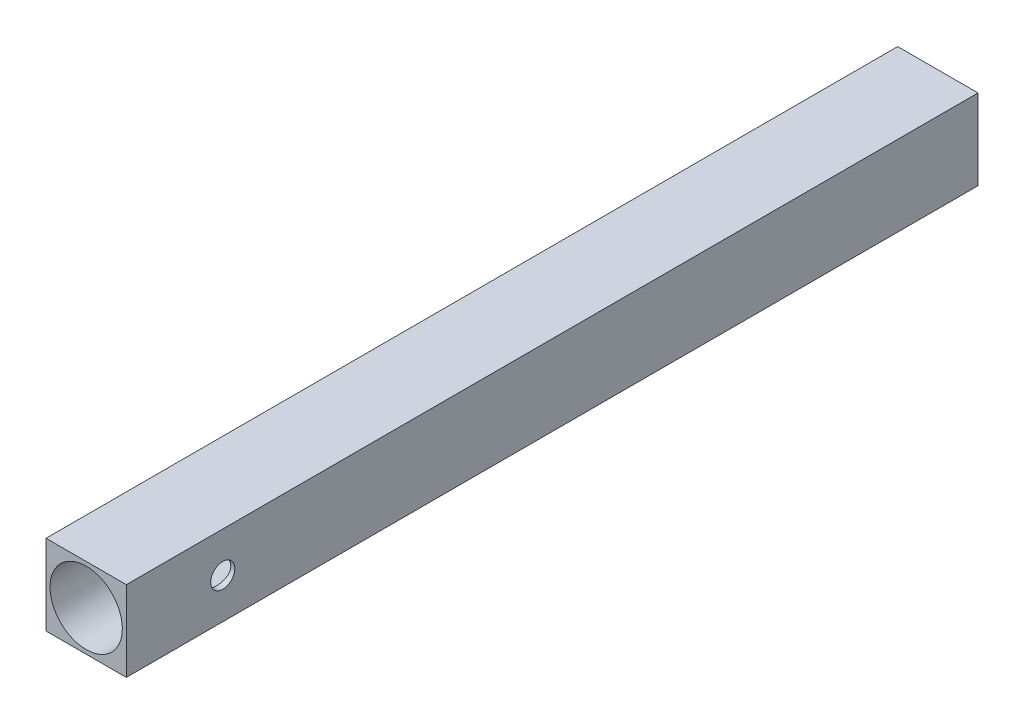
ISO-10303-21;
HEADER;
FILE_DESCRIPTION(('STEP AP214'),'2;1');
FILE_NAME('part.step','',(''),(''),'','','');
FILE_SCHEMA(('AUTOMOTIVE_DESIGN { 1 0 10303 214 1 1 1 1 }'));
ENDSEC;
DATA;
#1=APPLICATION_CONTEXT('core data for automotive mechanical design processes');
#2=APPLICATION_PROTOCOL_DEFINITION('international standard','automotive_design',2000,#1);
#3=PRODUCT_CONTEXT('',#1,'mechanical');
#4=PRODUCT('Part','Part','',(#3));
#5=PRODUCT_RELATED_PRODUCT_CATEGORY('part','',(#4));
#6=PRODUCT_DEFINITION_FORMATION('','',#4);
#7=PRODUCT_DEFINITION_CONTEXT('part definition',#1,'design');
#8=PRODUCT_DEFINITION('design','',#6,#7);
#9=PRODUCT_DEFINITION_SHAPE('','',#8);
#10=(LENGTH_UNIT() NAMED_UNIT(*) SI_UNIT(.MILLI.,.METRE.));
#11=(NAMED_UNIT(*) PLANE_ANGLE_UNIT() SI_UNIT($,.RADIAN.));
#12=(NAMED_UNIT(*) SI_UNIT($,.STERADIAN.) SOLID_ANGLE_UNIT());
#13=UNCERTAINTY_MEASURE_WITH_UNIT(LENGTH_MEASURE(1.E-05),#10,'distance_accuracy_value','');
#14=(GEOMETRIC_REPRESENTATION_CONTEXT(3) GLOBAL_UNCERTAINTY_ASSIGNED_CONTEXT((#13)) GLOBAL_UNIT_ASSIGNED_CONTEXT((#10,
#11,#12)) REPRESENTATION_CONTEXT('',''));
#15=CARTESIAN_POINT('',(0.,0.,0.));
#16=DIRECTION('',(0.,0.,1.));
#17=DIRECTION('',(1.,0.,0.));
#18=AXIS2_PLACEMENT_3D('',#15,#16,#17);
#19=CARTESIAN_POINT('',(0.,0.,190.));
#20=DIRECTION('',(0.,0.,1.));
#21=DIRECTION('',(1.,0.,0.));
#22=AXIS2_PLACEMENT_3D('',#19,#20,#21);
#23=PLANE('',#22);
#24=DIRECTION('',(0.,-1.,0.));
#25=VECTOR('',#24,1.);
#26=CARTESIAN_POINT('',(-10.,10.,190.));
#27=LINE('',#26,#25);
#28=CARTESIAN_POINT('',(-10.,10.,190.));
#29=VERTEX_POINT('',#28);
#30=CARTESIAN_POINT('',(-10.,-10.,190.));
#31=VERTEX_POINT('',#30);
#32=EDGE_CURVE('E83',#29,#31,#27,.T.);
#33=ORIENTED_EDGE('',*,*,#32,.T.);
#34=DIRECTION('',(1.,0.,0.));
#35=VECTOR('',#34,1.);
#36=CARTESIAN_POINT('',(-10.,-10.,190.));
#37=LINE('',#36,#35);
#38=CARTESIAN_POINT('',(10.,-10.,190.));
#39=VERTEX_POINT('',#38);
#40=EDGE_CURVE('E113',#31,#39,#37,.T.);
#41=ORIENTED_EDGE('',*,*,#40,.T.);
#42=DIRECTION('',(0.,1.,0.));
#43=VECTOR('',#42,1.);
#44=CARTESIAN_POINT('',(10.,10.,190.));
#45=LINE('',#44,#43);
#46=CARTESIAN_POINT('',(10.,10.,190.));
#47=VERTEX_POINT('',#46);
#48=EDGE_CURVE('E58',#39,#47,#45,.T.);
#49=ORIENTED_EDGE('',*,*,#48,.T.);
#50=DIRECTION('',(-1.,0.,0.));
#51=VECTOR('',#50,1.);
#52=CARTESIAN_POINT('',(-10.,10.,190.));
#53=LINE('',#52,#51);
#54=EDGE_CURVE('E53',#47,#29,#53,.T.);
#55=ORIENTED_EDGE('',*,*,#54,.T.);
#56=EDGE_LOOP('',(#33,#41,#49,#55));
#57=FACE_BOUND('',#56,.T.);
#58=CARTESIAN_POINT('',(0.,0.,190.));
#59=DIRECTION('',(0.,0.,1.));
#60=DIRECTION('',(1.,0.,0.));
#61=AXIS2_PLACEMENT_3D('',#58,#59,#60);
#62=CIRCLE('',#61,9.);
#63=CARTESIAN_POINT('',(9.,0.,190.));
#64=VERTEX_POINT('',#63);
#65=EDGE_CURVE('E107',#64,#64,#62,.T.);
#66=ORIENTED_EDGE('',*,*,#65,.F.);
#67=EDGE_LOOP('',(#66));
#68=FACE_BOUND('',#67,.T.);
#69=ADVANCED_FACE('F32',(#57,#68),#23,.T.);
#70=CARTESIAN_POINT('',(-10.,10.,190.));
#71=DIRECTION('',(1.,0.,0.));
#72=DIRECTION('',(0.,1.,0.));
#73=AXIS2_PLACEMENT_3D('',#70,#71,#72);
#74=PLANE('',#73);
#75=DIRECTION('',(0.,0.,-1.));
#76=VECTOR('',#75,1.);
#77=CARTESIAN_POINT('',(-10.,10.,190.));
#78=LINE('',#77,#76);
#79=CARTESIAN_POINT('',(-10.,10.,-22.));
#80=VERTEX_POINT('',#79);
#81=EDGE_CURVE('E78',#29,#80,#78,.T.);
#82=ORIENTED_EDGE('',*,*,#81,.T.);
#83=DIRECTION('',(0.,1.,0.));
#84=VECTOR('',#83,1.);
#85=CARTESIAN_POINT('',(-10.,10.,-22.));
#86=LINE('',#85,#84);
#87=CARTESIAN_POINT('',(-10.,-10.,-22.));
#88=VERTEX_POINT('',#87);
#89=EDGE_CURVE('E82',#88,#80,#86,.T.);
#90=ORIENTED_EDGE('',*,*,#89,.F.);
#91=DIRECTION('',(0.,0.,-1.));
#92=VECTOR('',#91,1.);
#93=CARTESIAN_POINT('',(-10.,-10.,190.));
#94=LINE('',#93,#92);
#95=EDGE_CURVE('E11',#31,#88,#94,.T.);
#96=ORIENTED_EDGE('',*,*,#95,.F.);
#97=ORIENTED_EDGE('',*,*,#32,.F.);
#98=EDGE_LOOP('',(#82,#90,#96,#97));
#99=FACE_BOUND('',#98,.T.);
#100=ADVANCED_FACE('F34',(#99),#74,.F.);
#101=CARTESIAN_POINT('',(-10.,-10.,190.));
#102=DIRECTION('',(0.,1.,0.));
#103=DIRECTION('',(0.,0.,1.));
#104=AXIS2_PLACEMENT_3D('',#101,#102,#103);
#105=PLANE('',#104);
#106=ORIENTED_EDGE('',*,*,#95,.T.);
#107=DIRECTION('',(-1.,0.,0.));
#108=VECTOR('',#107,1.);
#109=CARTESIAN_POINT('',(-10.,-10.,-22.));
#110=LINE('',#109,#108);
#111=CARTESIAN_POINT('',(10.,-10.,-22.));
#112=VERTEX_POINT('',#111);
#113=EDGE_CURVE('E98',#112,#88,#110,.T.);
#114=ORIENTED_EDGE('',*,*,#113,.F.);
#115=DIRECTION('',(0.,0.,-1.));
#116=VECTOR('',#115,1.);
#117=CARTESIAN_POINT('',(10.,-10.,190.));
#118=LINE('',#117,#116);
#119=EDGE_CURVE('E46',#39,#112,#118,.T.);
#120=ORIENTED_EDGE('',*,*,#119,.F.);
#121=ORIENTED_EDGE('',*,*,#40,.F.);
#122=EDGE_LOOP('',(#106,#114,#120,#121));
#123=FACE_BOUND('',#122,.T.);
#124=ADVANCED_FACE('F122',(#123),#105,.F.);
#125=CARTESIAN_POINT('',(10.,10.,190.));
#126=DIRECTION('',(-1.,0.,0.));
#127=DIRECTION('',(0.,-1.,0.));
#128=AXIS2_PLACEMENT_3D('',#125,#126,#127);
#129=PLANE('',#128);
#130=CARTESIAN_POINT('',(10.,0.,166.));
#131=DIRECTION('',(1.,0.,0.));
#132=DIRECTION('',(0.,1.,0.));
#133=AXIS2_PLACEMENT_3D('',#130,#131,#132);
#134=CIRCLE('',#133,2.99999999999999);
#135=CARTESIAN_POINT('',(10.,2.99999999999999,166.));
#136=VERTEX_POINT('',#135);
#137=EDGE_CURVE('E101',#136,#136,#134,.T.);
#138=ORIENTED_EDGE('',*,*,#137,.F.);
#139=EDGE_LOOP('',(#138));
#140=FACE_BOUND('',#139,.T.);
#141=ORIENTED_EDGE('',*,*,#119,.T.);
#142=DIRECTION('',(0.,-1.,0.));
#143=VECTOR('',#142,1.);
#144=CARTESIAN_POINT('',(10.,10.,-22.));
#145=LINE('',#144,#143);
#146=CARTESIAN_POINT('',(10.,10.,-22.));
#147=VERTEX_POINT('',#146);
#148=EDGE_CURVE('E93',#147,#112,#145,.T.);
#149=ORIENTED_EDGE('',*,*,#148,.F.);
#150=DIRECTION('',(0.,0.,-1.));
#151=VECTOR('',#150,1.);
#152=CARTESIAN_POINT('',(10.,10.,190.));
#153=LINE('',#152,#151);
#154=EDGE_CURVE('E85',#47,#147,#153,.T.);
#155=ORIENTED_EDGE('',*,*,#154,.F.);
#156=ORIENTED_EDGE('',*,*,#48,.F.);
#157=EDGE_LOOP('',(#141,#149,#155,#156));
#158=FACE_BOUND('',#157,.T.);
#159=ADVANCED_FACE('F120',(#140,#158),#129,.F.);
#160=CARTESIAN_POINT('',(-10.,10.,190.));
#161=DIRECTION('',(0.,-1.,0.));
#162=DIRECTION('',(1.,0.,0.));
#163=AXIS2_PLACEMENT_3D('',#160,#161,#162);
#164=PLANE('',#163);
#165=ORIENTED_EDGE('',*,*,#154,.T.);
#166=DIRECTION('',(1.,0.,0.));
#167=VECTOR('',#166,1.);
#168=CARTESIAN_POINT('',(-10.,10.,-22.));
#169=LINE('',#168,#167);
#170=EDGE_CURVE('E88',#80,#147,#169,.T.);
#171=ORIENTED_EDGE('',*,*,#170,.F.);
#172=ORIENTED_EDGE('',*,*,#81,.F.);
#173=ORIENTED_EDGE('',*,*,#54,.F.);
#174=EDGE_LOOP('',(#165,#171,#172,#173));
#175=FACE_BOUND('',#174,.T.);
#176=ADVANCED_FACE('F89',(#175),#164,.F.);
#177=CARTESIAN_POINT('',(0.,0.,190.));
#178=DIRECTION('',(0.,0.,-1.));
#179=DIRECTION('',(-1.,0.,0.));
#180=AXIS2_PLACEMENT_3D('',#177,#178,#179);
#181=CYLINDRICAL_SURFACE('',#180,9.);
#182=CARTESIAN_POINT('',(8.48528137423857,2.99999999999999,166.));
#183=CARTESIAN_POINT('',(8.48528083591302,3.00000077384313,165.836595475492));
#184=CARTESIAN_POINT('',(8.49005307872572,2.98660435105656,165.673195600529));
#185=CARTESIAN_POINT('',(8.50852722243764,2.93355339506642,165.351236737017));
#186=CARTESIAN_POINT('',(8.52223059426566,2.89389453650519,165.192678550383));
#187=CARTESIAN_POINT('',(8.55684611066375,2.78986645705471,164.885119321008));
#188=CARTESIAN_POINT('',(8.57774411913966,2.72554566420973,164.736100211672));
#189=CARTESIAN_POINT('',(8.62437366030974,2.57418488532413,164.450919854356));
#190=CARTESIAN_POINT('',(8.65010625910837,2.48713988658054,164.314761452339));
#191=CARTESIAN_POINT('',(8.70463468222419,2.28915343932863,164.053840112985));
#192=CARTESIAN_POINT('',(8.73350684533932,2.17747302413376,163.929653713985));
#193=CARTESIAN_POINT('',(8.79041594403009,1.93496300164319,163.701379596326));
#194=CARTESIAN_POINT('',(8.81845274486884,1.80413032515713,163.597295105253));
#195=CARTESIAN_POINT('',(8.87141600765397,1.52281352389503,163.409563308011));
#196=CARTESIAN_POINT('',(8.89624223104816,1.37190573367358,163.326520088146));
#197=CARTESIAN_POINT('',(8.93908760312949,1.05729366896243,163.187225244617));
#198=CARTESIAN_POINT('',(8.95710858609006,0.893592857061646,163.130966400469));
#199=CARTESIAN_POINT('',(8.9837722629572,0.564086452300496,163.048792436103));
#200=CARTESIAN_POINT('',(8.99271944332677,0.398552264558916,163.021889661229));
#201=CARTESIAN_POINT('',(9.00130824654743,0.0650936244722784,162.996051119918));
#202=CARTESIAN_POINT('',(9.00095226788686,-0.102830200631679,162.997108145043));
#203=CARTESIAN_POINT('',(8.99118118856194,-0.429310545581436,163.026532763698));
#204=CARTESIAN_POINT('',(8.98212194265352,-0.587976145774965,163.053827585423));
#205=CARTESIAN_POINT('',(8.95640902019194,-0.89833031646651,163.133178942941));
#206=CARTESIAN_POINT('',(8.93975482893545,-1.05001841333764,163.185237156939));
#207=CARTESIAN_POINT('',(8.90027010879673,-1.34445742452591,163.313263951918));
#208=CARTESIAN_POINT('',(8.87736127572047,-1.48706466290653,163.38953781564));
#209=CARTESIAN_POINT('',(8.82775179116757,-1.75777297658196,163.563579116346));
#210=CARTESIAN_POINT('',(8.80105008604401,-1.88587000315601,163.661352529983));
#211=CARTESIAN_POINT('',(8.7451857554969,-2.13030259965391,163.881023180379));
#212=CARTESIAN_POINT('',(8.71596645506633,-2.2458004711958,164.003839473524));
#213=CARTESIAN_POINT('',(8.65942005746702,-2.4548317787945,164.26734617718));
#214=CARTESIAN_POINT('',(8.63209325236846,-2.54836182984462,164.408039337184));
#215=CARTESIAN_POINT('',(8.58211575363337,-2.71196236510722,164.70596087681));
#216=CARTESIAN_POINT('',(8.55953727854244,-2.78167939086401,164.863396393953));
#217=CARTESIAN_POINT('',(8.52244952473154,-2.893329579808,165.188714182643));
#218=CARTESIAN_POINT('',(8.50793686461278,-2.93527438724248,165.356592043619));
#219=CARTESIAN_POINT('',(8.48938908946755,-2.98848384629256,165.689915066235));
#220=CARTESIAN_POINT('',(8.48491080956268,-3.00104728652289,165.855128274246));
#221=CARTESIAN_POINT('',(8.48570016177553,-2.99881631672915,166.185328447342));
#222=CARTESIAN_POINT('',(8.49096602375443,-2.98402687568029,166.350315448072));
#223=CARTESIAN_POINT('',(8.51020854270898,-2.92867695465693,166.669470897136));
#224=CARTESIAN_POINT('',(8.52387976322521,-2.88901918194205,166.823816290452));
#225=CARTESIAN_POINT('',(8.55805661013069,-2.78614158768141,167.123630818718));
#226=CARTESIAN_POINT('',(8.57856344804518,-2.72291758909027,167.269098374772));
#227=CARTESIAN_POINT('',(8.6249063278736,-2.57242302221682,167.552141262541));
#228=CARTESIAN_POINT('',(8.65089076996885,-2.48445335507549,167.689319927925));
#229=CARTESIAN_POINT('',(8.70497306192896,-2.28775689167268,167.947438157151));
#230=CARTESIAN_POINT('',(8.73307153331383,-2.17902397649636,168.068372915984));
#231=CARTESIAN_POINT('',(8.78985115913547,-1.937675117701,168.296583952272));
#232=CARTESIAN_POINT('',(8.81849530733689,-1.80416181163997,168.402923170057));
#233=CARTESIAN_POINT('',(8.87180554839326,-1.52048187420078,168.591748427044));
#234=CARTESIAN_POINT('',(8.89647178253084,-1.37031583459367,168.674235313487));
#235=CARTESIAN_POINT('',(8.93893217431809,-1.0583395872969,168.812260314585));
#236=CARTESIAN_POINT('',(8.95677090013593,-0.896613369963603,168.867973831444));
#237=CARTESIAN_POINT('',(8.98375832513323,-0.565375397538064,168.95118322618));
#238=CARTESIAN_POINT('',(8.99291016102056,-0.395866475861685,168.978689289642));
#239=CARTESIAN_POINT('',(9.00125589708769,-0.062446007580142,169.003786232817));
#240=CARTESIAN_POINT('',(9.00089760268317,0.101354171760037,169.002722361797));
#241=CARTESIAN_POINT('',(8.99136589558194,0.426333435000506,168.974028075561));
#242=CARTESIAN_POINT('',(8.98219319800727,0.587512730457158,168.946399815542));
#243=CARTESIAN_POINT('',(8.95622744863237,0.900126358296163,168.866253296272));
#244=CARTESIAN_POINT('',(8.93955775083446,1.05167481273835,168.814137353941));
#245=CARTESIAN_POINT('',(8.90031482113485,1.34393505281937,168.686867406709));
#246=CARTESIAN_POINT('',(8.87774052144049,1.48464487242728,168.611709234409));
#247=CARTESIAN_POINT('',(8.82797606483643,1.75690204892634,168.437291463694));
#248=CARTESIAN_POINT('',(8.8006461747578,1.88791875467281,168.337243943855));
#249=CARTESIAN_POINT('',(8.74478966375639,2.13174307881727,168.117227826531));
#250=CARTESIAN_POINT('',(8.71626266319292,2.24454486487376,167.997252873212));
#251=CARTESIAN_POINT('',(8.65989839476795,2.45322542649934,167.735171933239));
#252=CARTESIAN_POINT('',(8.63213183965892,2.5482688979937,167.59238346707));
#253=CARTESIAN_POINT('',(8.58180579969046,2.71294302990334,167.291996719292));
#254=CARTESIAN_POINT('',(8.55924495483748,2.78258033045842,167.134402320911));
#255=CARTESIAN_POINT('',(8.52304002619544,2.89153148461249,166.816114527953));
#256=CARTESIAN_POINT('',(8.50903898571547,2.93207372744855,166.655883209424));
#257=CARTESIAN_POINT('',(8.49016150618555,2.9863029604478,166.3304318486));
#258=CARTESIAN_POINT('',(8.48528191852383,2.99999921758977,166.165213547768));
#259=CARTESIAN_POINT('',(8.48528137423857,2.99999999999999,166.));
#260=B_SPLINE_CURVE_WITH_KNOTS('',3,(#182,#183,#184,#185,#186,#187,#188,#189,#190,#191,#192,
#193,#194,#195,#196,#197,#198,#199,#200,#201,#202,#203,#204,#205,#206,#207,#208,#209,#210,#211,
#212,#213,#214,#215,#216,#217,#218,#219,#220,#221,#222,#223,#224,#225,#226,#227,#228,#229,#230,
#231,#232,#233,#234,#235,#236,#237,#238,#239,#240,#241,#242,#243,#244,#245,#246,#247,#248,#249,
#250,#251,#252,#253,#254,#255,#256,#257,#258,#259),.UNSPECIFIED.,.T.,.F.,(4,2,2,2,2,2,2,2,2,2,2,
2,2,2,2,2,2,2,2,2,2,2,2,2,2,2,2,2,2,2,2,2,2,2,2,2,2,2,4),(0.,0.489601754398035,
0.979284165045477,1.46800988250249,1.9568434985563,2.46304012282703,2.96931795515962,
3.48880518430969,4.00815229160365,4.50942956294801,5.0105775990698,5.49207014476705,
5.97359532567707,6.46144964581003,6.94943975622063,7.46040523091749,7.97144938836315,
8.48977919529162,9.00789154069845,9.50262874093315,9.99727607511699,10.4749318730632,
10.9526723744083,11.4455657320714,11.9386045698638,12.4553642451327,12.9721055627259,
13.4854137357255,13.9985364901246,14.487542540329,14.9765089202934,15.4577086812129,
15.9389955228972,16.438065585619,16.9372951329789,17.4560670820843,17.974703348006,
18.4698963648807,18.9649184157139),.UNSPECIFIED.);
#261=CARTESIAN_POINT('',(8.48528137423857,2.99999999999999,166.));
#262=VERTEX_POINT('',#261);
#263=EDGE_CURVE('E36',#262,#262,#260,.T.);
#264=ORIENTED_EDGE('',*,*,#263,.F.);
#265=EDGE_LOOP('',(#264));
#266=FACE_BOUND('',#265,.T.);
#267=ORIENTED_EDGE('',*,*,#65,.T.);
#268=EDGE_LOOP('',(#267));
#269=FACE_BOUND('',#268,.T.);
#270=CARTESIAN_POINT('',(0.,0.,0.));
#271=DIRECTION('',(0.,0.,1.));
#272=DIRECTION('',(1.,0.,0.));
#273=AXIS2_PLACEMENT_3D('',#270,#271,#272);
#274=CIRCLE('',#273,9.);
#275=CARTESIAN_POINT('',(9.,0.,0.));
#276=VERTEX_POINT('',#275);
#277=EDGE_CURVE('E106',#276,#276,#274,.T.);
#278=ORIENTED_EDGE('',*,*,#277,.F.);
#279=EDGE_LOOP('',(#278));
#280=FACE_BOUND('',#279,.T.);
#281=ADVANCED_FACE('F128',(#266,#269,#280),#181,.F.);
#282=CARTESIAN_POINT('',(0.,0.,0.));
#283=DIRECTION('',(0.,0.,1.));
#284=DIRECTION('',(1.,0.,0.));
#285=AXIS2_PLACEMENT_3D('',#282,#283,#284);
#286=PLANE('',#285);
#287=ORIENTED_EDGE('',*,*,#277,.T.);
#288=EDGE_LOOP('',(#287));
#289=FACE_BOUND('',#288,.T.);
#290=ADVANCED_FACE('F131',(#289),#286,.T.);
#291=CARTESIAN_POINT('',(0.,0.,-22.));
#292=DIRECTION('',(0.,0.,1.));
#293=DIRECTION('',(1.,0.,0.));
#294=AXIS2_PLACEMENT_3D('',#291,#292,#293);
#295=PLANE('',#294);
#296=ORIENTED_EDGE('',*,*,#89,.T.);
#297=ORIENTED_EDGE('',*,*,#170,.T.);
#298=ORIENTED_EDGE('',*,*,#148,.T.);
#299=ORIENTED_EDGE('',*,*,#113,.T.);
#300=EDGE_LOOP('',(#296,#297,#298,#299));
#301=FACE_BOUND('',#300,.T.);
#302=ADVANCED_FACE('F96',(#301),#295,.F.);
#303=CARTESIAN_POINT('',(0.,0.,166.));
#304=DIRECTION('',(1.,0.,0.));
#305=DIRECTION('',(0.,1.,0.));
#306=AXIS2_PLACEMENT_3D('',#303,#304,#305);
#307=CYLINDRICAL_SURFACE('',#306,2.99999999999999);
#308=ORIENTED_EDGE('',*,*,#263,.T.);
#309=EDGE_LOOP('',(#308));
#310=FACE_BOUND('',#309,.T.);
#311=ORIENTED_EDGE('',*,*,#137,.T.);
#312=EDGE_LOOP('',(#311));
#313=FACE_BOUND('',#312,.T.);
#314=ADVANCED_FACE('F140',(#310,#313),#307,.F.);
#315=CLOSED_SHELL('',(#69,#100,#124,#159,#176,#281,#290,#302,#314));
#316=MANIFOLD_SOLID_BREP('B2',#315);
#317=ADVANCED_BREP_SHAPE_REPRESENTATION('',(#18,#316),#14);
#318=SHAPE_DEFINITION_REPRESENTATION(#9,#317);
ENDSEC;
END-ISO-10303-21;
